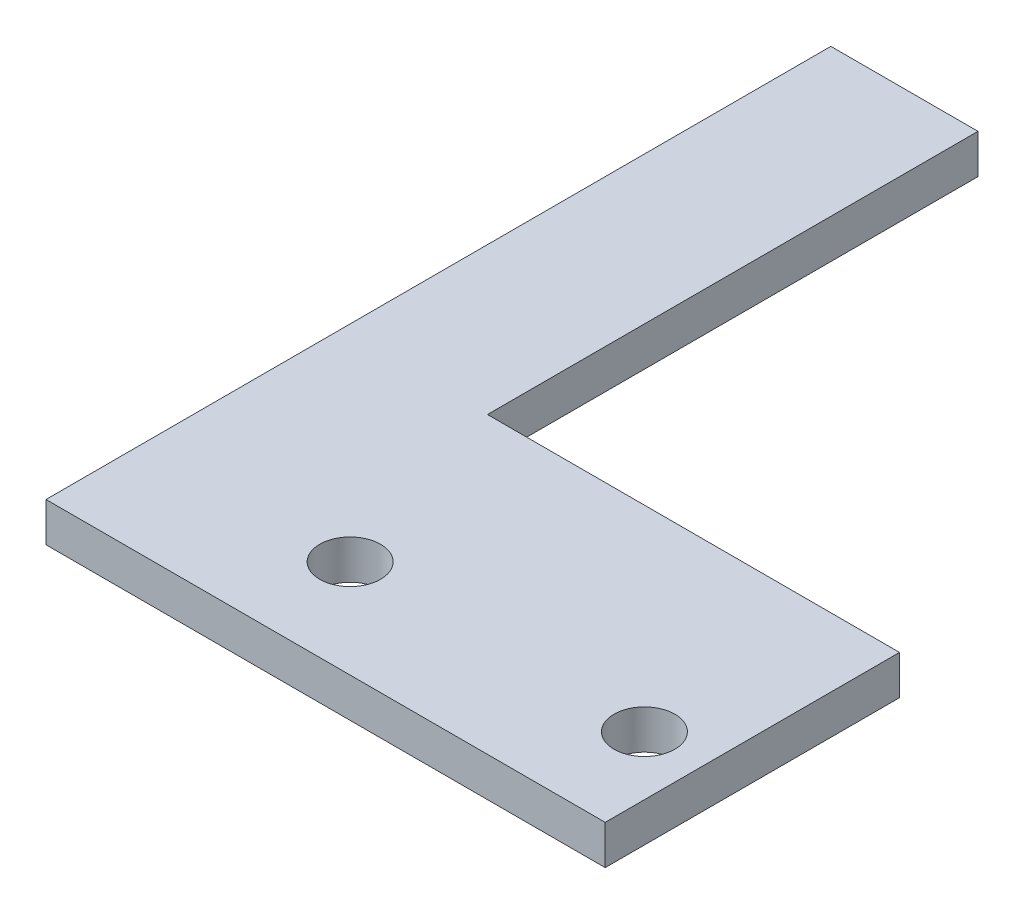
ISO-10303-21;
HEADER;
FILE_DESCRIPTION(('STEP AP214'),'2;1');
FILE_NAME('part.step','',(''),(''),'','','');
FILE_SCHEMA(('AUTOMOTIVE_DESIGN { 1 0 10303 214 1 1 1 1 }'));
ENDSEC;
DATA;
#1=APPLICATION_CONTEXT('core data for automotive mechanical design processes');
#2=APPLICATION_PROTOCOL_DEFINITION('international standard','automotive_design',2000,#1);
#3=PRODUCT_CONTEXT('',#1,'mechanical');
#4=PRODUCT('Part','Part','',(#3));
#5=PRODUCT_RELATED_PRODUCT_CATEGORY('part','',(#4));
#6=PRODUCT_DEFINITION_FORMATION('','',#4);
#7=PRODUCT_DEFINITION_CONTEXT('part definition',#1,'design');
#8=PRODUCT_DEFINITION('design','',#6,#7);
#9=PRODUCT_DEFINITION_SHAPE('','',#8);
#10=(LENGTH_UNIT() NAMED_UNIT(*) SI_UNIT(.MILLI.,.METRE.));
#11=(NAMED_UNIT(*) PLANE_ANGLE_UNIT() SI_UNIT($,.RADIAN.));
#12=(NAMED_UNIT(*) SI_UNIT($,.STERADIAN.) SOLID_ANGLE_UNIT());
#13=UNCERTAINTY_MEASURE_WITH_UNIT(LENGTH_MEASURE(1.E-05),#10,'distance_accuracy_value','');
#14=(GEOMETRIC_REPRESENTATION_CONTEXT(3) GLOBAL_UNCERTAINTY_ASSIGNED_CONTEXT((#13)) GLOBAL_UNIT_ASSIGNED_CONTEXT((#10,
#11,#12)) REPRESENTATION_CONTEXT('',''));
#15=CARTESIAN_POINT('',(0.,0.,0.));
#16=DIRECTION('',(0.,0.,1.));
#17=DIRECTION('',(1.,0.,0.));
#18=AXIS2_PLACEMENT_3D('',#15,#16,#17);
#19=CARTESIAN_POINT('',(28.5,2.,0.));
#20=DIRECTION('',(0.,0.,-1.));
#21=DIRECTION('',(-1.,0.,0.));
#22=AXIS2_PLACEMENT_3D('',#19,#20,#21);
#23=PLANE('',#22);
#24=DIRECTION('',(1.,0.,0.));
#25=VECTOR('',#24,1.);
#26=CARTESIAN_POINT('',(28.5,0.,0.));
#27=LINE('',#26,#25);
#28=CARTESIAN_POINT('',(0.,0.,0.));
#29=VERTEX_POINT('',#28);
#30=CARTESIAN_POINT('',(28.5,0.,0.));
#31=VERTEX_POINT('',#30);
#32=EDGE_CURVE('E119',#29,#31,#27,.T.);
#33=ORIENTED_EDGE('',*,*,#32,.T.);
#34=DIRECTION('',(0.,-1.,0.));
#35=VECTOR('',#34,1.);
#36=CARTESIAN_POINT('',(28.5,2.,0.));
#37=LINE('',#36,#35);
#38=CARTESIAN_POINT('',(28.5,2.,0.));
#39=VERTEX_POINT('',#38);
#40=EDGE_CURVE('E11',#39,#31,#37,.T.);
#41=ORIENTED_EDGE('',*,*,#40,.F.);
#42=DIRECTION('',(1.,0.,0.));
#43=VECTOR('',#42,1.);
#44=CARTESIAN_POINT('',(28.5,2.,0.));
#45=LINE('',#44,#43);
#46=CARTESIAN_POINT('',(0.,2.,0.));
#47=VERTEX_POINT('',#46);
#48=EDGE_CURVE('E130',#47,#39,#45,.T.);
#49=ORIENTED_EDGE('',*,*,#48,.F.);
#50=DIRECTION('',(0.,-1.,0.));
#51=VECTOR('',#50,1.);
#52=CARTESIAN_POINT('',(0.,2.,0.));
#53=LINE('',#52,#51);
#54=EDGE_CURVE('E115',#47,#29,#53,.T.);
#55=ORIENTED_EDGE('',*,*,#54,.T.);
#56=EDGE_LOOP('',(#33,#41,#49,#55));
#57=FACE_BOUND('',#56,.T.);
#58=ADVANCED_FACE('F34',(#57),#23,.F.);
#59=CARTESIAN_POINT('',(28.5,2.,-15.));
#60=DIRECTION('',(-1.,0.,0.));
#61=DIRECTION('',(0.,0.,1.));
#62=AXIS2_PLACEMENT_3D('',#59,#60,#61);
#63=PLANE('',#62);
#64=DIRECTION('',(0.,0.,-1.));
#65=VECTOR('',#64,1.);
#66=CARTESIAN_POINT('',(28.5,0.,-15.));
#67=LINE('',#66,#65);
#68=CARTESIAN_POINT('',(28.5,0.,-15.));
#69=VERTEX_POINT('',#68);
#70=EDGE_CURVE('E122',#31,#69,#67,.T.);
#71=ORIENTED_EDGE('',*,*,#70,.T.);
#72=DIRECTION('',(0.,-1.,0.));
#73=VECTOR('',#72,1.);
#74=CARTESIAN_POINT('',(28.5,2.,-15.));
#75=LINE('',#74,#73);
#76=CARTESIAN_POINT('',(28.5,2.,-15.));
#77=VERTEX_POINT('',#76);
#78=EDGE_CURVE('E43',#77,#69,#75,.T.);
#79=ORIENTED_EDGE('',*,*,#78,.F.);
#80=DIRECTION('',(0.,0.,-1.));
#81=VECTOR('',#80,1.);
#82=CARTESIAN_POINT('',(28.5,2.,-15.));
#83=LINE('',#82,#81);
#84=EDGE_CURVE('E88',#39,#77,#83,.T.);
#85=ORIENTED_EDGE('',*,*,#84,.F.);
#86=ORIENTED_EDGE('',*,*,#40,.T.);
#87=EDGE_LOOP('',(#71,#79,#85,#86));
#88=FACE_BOUND('',#87,.T.);
#89=ADVANCED_FACE('F156',(#88),#63,.F.);
#90=CARTESIAN_POINT('',(7.5,2.,-15.));
#91=DIRECTION('',(0.,0.,1.));
#92=DIRECTION('',(1.,0.,0.));
#93=AXIS2_PLACEMENT_3D('',#90,#91,#92);
#94=PLANE('',#93);
#95=DIRECTION('',(-1.,0.,0.));
#96=VECTOR('',#95,1.);
#97=CARTESIAN_POINT('',(7.5,0.,-15.));
#98=LINE('',#97,#96);
#99=CARTESIAN_POINT('',(7.5,0.,-15.));
#100=VERTEX_POINT('',#99);
#101=EDGE_CURVE('E125',#69,#100,#98,.T.);
#102=ORIENTED_EDGE('',*,*,#101,.T.);
#103=DIRECTION('',(0.,-1.,0.));
#104=VECTOR('',#103,1.);
#105=CARTESIAN_POINT('',(7.5,2.,-15.));
#106=LINE('',#105,#104);
#107=CARTESIAN_POINT('',(7.5,2.,-15.));
#108=VERTEX_POINT('',#107);
#109=EDGE_CURVE('E110',#108,#100,#106,.T.);
#110=ORIENTED_EDGE('',*,*,#109,.F.);
#111=DIRECTION('',(-1.,0.,0.));
#112=VECTOR('',#111,1.);
#113=CARTESIAN_POINT('',(7.5,2.,-15.));
#114=LINE('',#113,#112);
#115=EDGE_CURVE('E101',#77,#108,#114,.T.);
#116=ORIENTED_EDGE('',*,*,#115,.F.);
#117=ORIENTED_EDGE('',*,*,#78,.T.);
#118=EDGE_LOOP('',(#102,#110,#116,#117));
#119=FACE_BOUND('',#118,.T.);
#120=ADVANCED_FACE('F137',(#119),#94,.F.);
#121=CARTESIAN_POINT('',(7.5,2.,-40.));
#122=DIRECTION('',(-1.,0.,0.));
#123=DIRECTION('',(0.,0.,1.));
#124=AXIS2_PLACEMENT_3D('',#121,#122,#123);
#125=PLANE('',#124);
#126=DIRECTION('',(0.,0.,-1.));
#127=VECTOR('',#126,1.);
#128=CARTESIAN_POINT('',(7.5,0.,-40.));
#129=LINE('',#128,#127);
#130=CARTESIAN_POINT('',(7.5,0.,-40.));
#131=VERTEX_POINT('',#130);
#132=EDGE_CURVE('E109',#100,#131,#129,.T.);
#133=ORIENTED_EDGE('',*,*,#132,.T.);
#134=DIRECTION('',(0.,-1.,0.));
#135=VECTOR('',#134,1.);
#136=CARTESIAN_POINT('',(7.5,2.,-40.));
#137=LINE('',#136,#135);
#138=CARTESIAN_POINT('',(7.5,2.,-40.));
#139=VERTEX_POINT('',#138);
#140=EDGE_CURVE('E106',#139,#131,#137,.T.);
#141=ORIENTED_EDGE('',*,*,#140,.F.);
#142=DIRECTION('',(0.,0.,-1.));
#143=VECTOR('',#142,1.);
#144=CARTESIAN_POINT('',(7.5,2.,-40.));
#145=LINE('',#144,#143);
#146=EDGE_CURVE('E95',#108,#139,#145,.T.);
#147=ORIENTED_EDGE('',*,*,#146,.F.);
#148=ORIENTED_EDGE('',*,*,#109,.T.);
#149=EDGE_LOOP('',(#133,#141,#147,#148));
#150=FACE_BOUND('',#149,.T.);
#151=ADVANCED_FACE('F107',(#150),#125,.F.);
#152=CARTESIAN_POINT('',(0.,2.,-40.));
#153=DIRECTION('',(0.,0.,1.));
#154=DIRECTION('',(1.,0.,0.));
#155=AXIS2_PLACEMENT_3D('',#152,#153,#154);
#156=PLANE('',#155);
#157=DIRECTION('',(-1.,0.,0.));
#158=VECTOR('',#157,1.);
#159=CARTESIAN_POINT('',(0.,0.,-40.));
#160=LINE('',#159,#158);
#161=CARTESIAN_POINT('',(0.,0.,-40.));
#162=VERTEX_POINT('',#161);
#163=EDGE_CURVE('E74',#131,#162,#160,.T.);
#164=ORIENTED_EDGE('',*,*,#163,.T.);
#165=DIRECTION('',(0.,-1.,0.));
#166=VECTOR('',#165,1.);
#167=CARTESIAN_POINT('',(0.,2.,-40.));
#168=LINE('',#167,#166);
#169=CARTESIAN_POINT('',(0.,2.,-40.));
#170=VERTEX_POINT('',#169);
#171=EDGE_CURVE('E111',#170,#162,#168,.T.);
#172=ORIENTED_EDGE('',*,*,#171,.F.);
#173=DIRECTION('',(-1.,0.,0.));
#174=VECTOR('',#173,1.);
#175=CARTESIAN_POINT('',(0.,2.,-40.));
#176=LINE('',#175,#174);
#177=EDGE_CURVE('E99',#139,#170,#176,.T.);
#178=ORIENTED_EDGE('',*,*,#177,.F.);
#179=ORIENTED_EDGE('',*,*,#140,.T.);
#180=EDGE_LOOP('',(#164,#172,#178,#179));
#181=FACE_BOUND('',#180,.T.);
#182=ADVANCED_FACE('F113',(#181),#156,.F.);
#183=CARTESIAN_POINT('',(0.,2.,0.));
#184=DIRECTION('',(1.,0.,0.));
#185=DIRECTION('',(0.,0.,-1.));
#186=AXIS2_PLACEMENT_3D('',#183,#184,#185);
#187=PLANE('',#186);
#188=DIRECTION('',(0.,0.,1.));
#189=VECTOR('',#188,1.);
#190=CARTESIAN_POINT('',(0.,0.,0.));
#191=LINE('',#190,#189);
#192=EDGE_CURVE('E80',#162,#29,#191,.T.);
#193=ORIENTED_EDGE('',*,*,#192,.T.);
#194=ORIENTED_EDGE('',*,*,#54,.F.);
#195=DIRECTION('',(0.,0.,1.));
#196=VECTOR('',#195,1.);
#197=CARTESIAN_POINT('',(0.,2.,0.));
#198=LINE('',#197,#196);
#199=EDGE_CURVE('E51',#170,#47,#198,.T.);
#200=ORIENTED_EDGE('',*,*,#199,.F.);
#201=ORIENTED_EDGE('',*,*,#171,.T.);
#202=EDGE_LOOP('',(#193,#194,#200,#201));
#203=FACE_BOUND('',#202,.T.);
#204=ADVANCED_FACE('F144',(#203),#187,.F.);
#205=CARTESIAN_POINT('',(0.,2.,0.));
#206=DIRECTION('',(0.,-1.,0.));
#207=DIRECTION('',(0.,0.,-1.));
#208=AXIS2_PLACEMENT_3D('',#205,#206,#207);
#209=PLANE('',#208);
#210=CARTESIAN_POINT('',(10.5,2.,-5.));
#211=DIRECTION('',(0.,1.,0.));
#212=DIRECTION('',(0.,0.,1.));
#213=AXIS2_PLACEMENT_3D('',#210,#211,#212);
#214=CIRCLE('',#213,1.55);
#215=CARTESIAN_POINT('',(10.5,2.,-3.45));
#216=VERTEX_POINT('',#215);
#217=EDGE_CURVE('E221',#216,#216,#214,.T.);
#218=ORIENTED_EDGE('',*,*,#217,.F.);
#219=EDGE_LOOP('',(#218));
#220=FACE_BOUND('',#219,.T.);
#221=CARTESIAN_POINT('',(25.5,2.,-5.));
#222=DIRECTION('',(0.,1.,0.));
#223=DIRECTION('',(0.,0.,1.));
#224=AXIS2_PLACEMENT_3D('',#221,#222,#223);
#225=CIRCLE('',#224,1.55);
#226=CARTESIAN_POINT('',(25.5,2.,-3.45));
#227=VERTEX_POINT('',#226);
#228=EDGE_CURVE('E223',#227,#227,#225,.T.);
#229=ORIENTED_EDGE('',*,*,#228,.F.);
#230=EDGE_LOOP('',(#229));
#231=FACE_BOUND('',#230,.T.);
#232=ORIENTED_EDGE('',*,*,#48,.T.);
#233=ORIENTED_EDGE('',*,*,#84,.T.);
#234=ORIENTED_EDGE('',*,*,#115,.T.);
#235=ORIENTED_EDGE('',*,*,#146,.T.);
#236=ORIENTED_EDGE('',*,*,#177,.T.);
#237=ORIENTED_EDGE('',*,*,#199,.T.);
#238=EDGE_LOOP('',(#232,#233,#234,#235,#236,#237));
#239=FACE_BOUND('',#238,.T.);
#240=ADVANCED_FACE('F97',(#220,#231,#239),#209,.F.);
#241=CARTESIAN_POINT('',(0.,0.,0.));
#242=DIRECTION('',(0.,-1.,0.));
#243=DIRECTION('',(0.,0.,-1.));
#244=AXIS2_PLACEMENT_3D('',#241,#242,#243);
#245=PLANE('',#244);
#246=CARTESIAN_POINT('',(10.5,0.,-5.));
#247=DIRECTION('',(0.,-1.,0.));
#248=DIRECTION('',(0.,0.,-1.));
#249=AXIS2_PLACEMENT_3D('',#246,#247,#248);
#250=CIRCLE('',#249,1.55);
#251=CARTESIAN_POINT('',(10.5,0.,-6.55));
#252=VERTEX_POINT('',#251);
#253=EDGE_CURVE('E37',#252,#252,#250,.T.);
#254=ORIENTED_EDGE('',*,*,#253,.F.);
#255=EDGE_LOOP('',(#254));
#256=FACE_BOUND('',#255,.T.);
#257=CARTESIAN_POINT('',(25.5,0.,-5.));
#258=DIRECTION('',(0.,-1.,0.));
#259=DIRECTION('',(0.,0.,-1.));
#260=AXIS2_PLACEMENT_3D('',#257,#258,#259);
#261=CIRCLE('',#260,1.55);
#262=CARTESIAN_POINT('',(25.5,0.,-6.55));
#263=VERTEX_POINT('',#262);
#264=EDGE_CURVE('E123',#263,#263,#261,.T.);
#265=ORIENTED_EDGE('',*,*,#264,.F.);
#266=EDGE_LOOP('',(#265));
#267=FACE_BOUND('',#266,.T.);
#268=ORIENTED_EDGE('',*,*,#32,.F.);
#269=ORIENTED_EDGE('',*,*,#192,.F.);
#270=ORIENTED_EDGE('',*,*,#163,.F.);
#271=ORIENTED_EDGE('',*,*,#132,.F.);
#272=ORIENTED_EDGE('',*,*,#101,.F.);
#273=ORIENTED_EDGE('',*,*,#70,.F.);
#274=EDGE_LOOP('',(#268,#269,#270,#271,#272,#273));
#275=FACE_BOUND('',#274,.T.);
#276=ADVANCED_FACE('F140',(#256,#267,#275),#245,.T.);
#277=CARTESIAN_POINT('',(25.5,2.,-5.));
#278=DIRECTION('',(0.,1.,0.));
#279=DIRECTION('',(0.,0.,1.));
#280=AXIS2_PLACEMENT_3D('',#277,#278,#279);
#281=CYLINDRICAL_SURFACE('',#280,1.55);
#282=ORIENTED_EDGE('',*,*,#264,.T.);
#283=EDGE_LOOP('',(#282));
#284=FACE_BOUND('',#283,.T.);
#285=ORIENTED_EDGE('',*,*,#228,.T.);
#286=EDGE_LOOP('',(#285));
#287=FACE_BOUND('',#286,.T.);
#288=ADVANCED_FACE('F193',(#284,#287),#281,.F.);
#289=CARTESIAN_POINT('',(10.5,2.,-5.));
#290=DIRECTION('',(0.,1.,0.));
#291=DIRECTION('',(0.,0.,1.));
#292=AXIS2_PLACEMENT_3D('',#289,#290,#291);
#293=CYLINDRICAL_SURFACE('',#292,1.55);
#294=ORIENTED_EDGE('',*,*,#253,.T.);
#295=EDGE_LOOP('',(#294));
#296=FACE_BOUND('',#295,.T.);
#297=ORIENTED_EDGE('',*,*,#217,.T.);
#298=EDGE_LOOP('',(#297));
#299=FACE_BOUND('',#298,.T.);
#300=ADVANCED_FACE('F202',(#296,#299),#293,.F.);
#301=CLOSED_SHELL('',(#58,#89,#120,#151,#182,#204,#240,#276,#288,#300));
#302=MANIFOLD_SOLID_BREP('B2',#301);
#303=ADVANCED_BREP_SHAPE_REPRESENTATION('',(#18,#302),#14);
#304=SHAPE_DEFINITION_REPRESENTATION(#9,#303);
ENDSEC;
END-ISO-10303-21;
